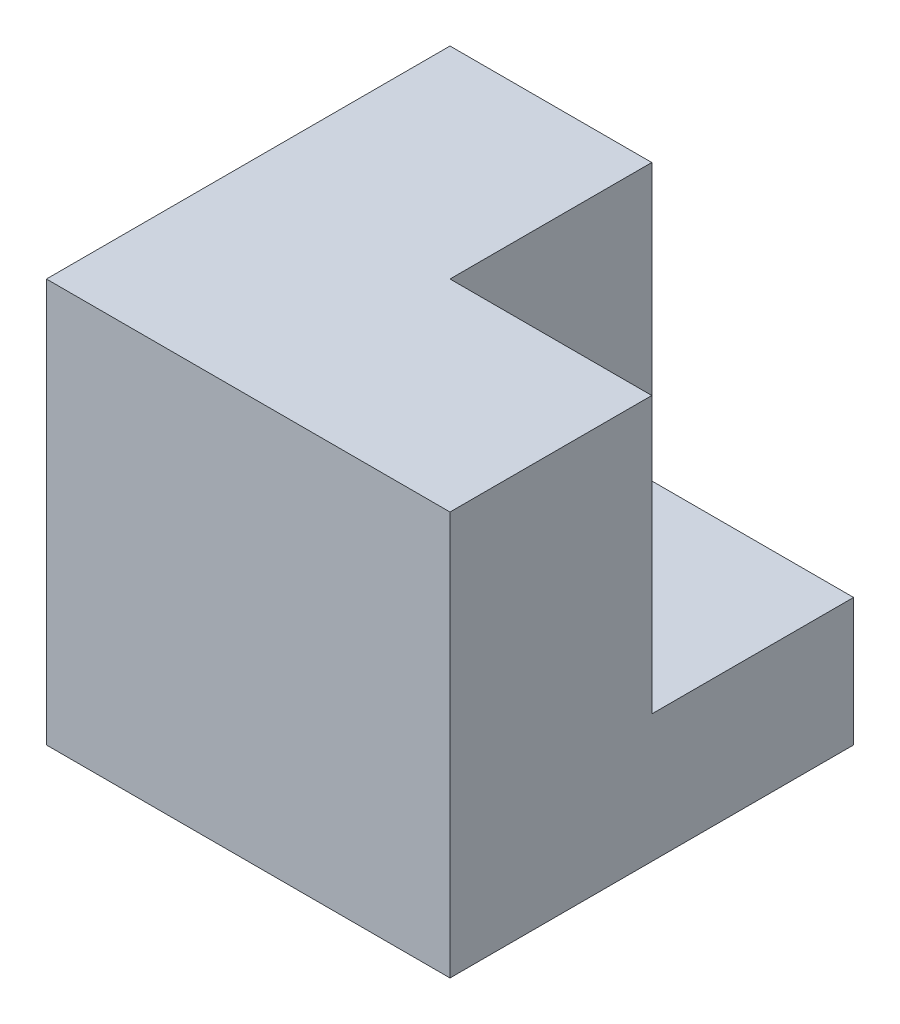
ISO-10303-21;
HEADER;
FILE_DESCRIPTION(('STEP AP214'),'2;1');
FILE_NAME('part.step','',(''),(''),'','','');
FILE_SCHEMA(('AUTOMOTIVE_DESIGN { 1 0 10303 214 1 1 1 1 }'));
ENDSEC;
DATA;
#1=APPLICATION_CONTEXT('core data for automotive mechanical design processes');
#2=APPLICATION_PROTOCOL_DEFINITION('international standard','automotive_design',2000,#1);
#3=PRODUCT_CONTEXT('',#1,'mechanical');
#4=PRODUCT('Part','Part','',(#3));
#5=PRODUCT_RELATED_PRODUCT_CATEGORY('part','',(#4));
#6=PRODUCT_DEFINITION_FORMATION('','',#4);
#7=PRODUCT_DEFINITION_CONTEXT('part definition',#1,'design');
#8=PRODUCT_DEFINITION('design','',#6,#7);
#9=PRODUCT_DEFINITION_SHAPE('','',#8);
#10=(LENGTH_UNIT() NAMED_UNIT(*) SI_UNIT(.MILLI.,.METRE.));
#11=(NAMED_UNIT(*) PLANE_ANGLE_UNIT() SI_UNIT($,.RADIAN.));
#12=(NAMED_UNIT(*) SI_UNIT($,.STERADIAN.) SOLID_ANGLE_UNIT());
#13=UNCERTAINTY_MEASURE_WITH_UNIT(LENGTH_MEASURE(1.E-05),#10,'distance_accuracy_value','');
#14=(GEOMETRIC_REPRESENTATION_CONTEXT(3) GLOBAL_UNCERTAINTY_ASSIGNED_CONTEXT((#13)) GLOBAL_UNIT_ASSIGNED_CONTEXT((#10,
#11,#12)) REPRESENTATION_CONTEXT('',''));
#15=CARTESIAN_POINT('',(0.,0.,0.));
#16=DIRECTION('',(0.,0.,1.));
#17=DIRECTION('',(1.,0.,0.));
#18=AXIS2_PLACEMENT_3D('',#15,#16,#17);
#19=CARTESIAN_POINT('',(0.,0.,76.2));
#20=DIRECTION('',(1.,0.,0.));
#21=DIRECTION('',(0.,0.,-1.));
#22=AXIS2_PLACEMENT_3D('',#19,#20,#21);
#23=PLANE('',#22);
#24=DIRECTION('',(0.,-1.,0.));
#25=VECTOR('',#24,1.);
#26=CARTESIAN_POINT('',(0.,0.,0.));
#27=LINE('',#26,#25);
#28=CARTESIAN_POINT('',(0.,76.2,0.));
#29=VERTEX_POINT('',#28);
#30=CARTESIAN_POINT('',(0.,0.,0.));
#31=VERTEX_POINT('',#30);
#32=EDGE_CURVE('E125',#29,#31,#27,.T.);
#33=ORIENTED_EDGE('',*,*,#32,.T.);
#34=DIRECTION('',(0.,0.,-1.));
#35=VECTOR('',#34,1.);
#36=CARTESIAN_POINT('',(0.,0.,76.2));
#37=LINE('',#36,#35);
#38=CARTESIAN_POINT('',(0.,0.,76.2));
#39=VERTEX_POINT('',#38);
#40=EDGE_CURVE('E11',#39,#31,#37,.T.);
#41=ORIENTED_EDGE('',*,*,#40,.F.);
#42=DIRECTION('',(0.,-1.,0.));
#43=VECTOR('',#42,1.);
#44=CARTESIAN_POINT('',(0.,0.,76.2));
#45=LINE('',#44,#43);
#46=CARTESIAN_POINT('',(0.,76.2,76.2));
#47=VERTEX_POINT('',#46);
#48=EDGE_CURVE('E127',#47,#39,#45,.T.);
#49=ORIENTED_EDGE('',*,*,#48,.F.);
#50=DIRECTION('',(0.,0.,-1.));
#51=VECTOR('',#50,1.);
#52=CARTESIAN_POINT('',(0.,76.2,76.2));
#53=LINE('',#52,#51);
#54=EDGE_CURVE('E138',#47,#29,#53,.T.);
#55=ORIENTED_EDGE('',*,*,#54,.T.);
#56=EDGE_LOOP('',(#33,#41,#49,#55));
#57=FACE_BOUND('',#56,.T.);
#58=ADVANCED_FACE('F39',(#57),#23,.F.);
#59=CARTESIAN_POINT('',(0.,0.,76.2));
#60=DIRECTION('',(0.,1.,0.));
#61=DIRECTION('',(0.,0.,1.));
#62=AXIS2_PLACEMENT_3D('',#59,#60,#61);
#63=PLANE('',#62);
#64=DIRECTION('',(1.,0.,0.));
#65=VECTOR('',#64,1.);
#66=CARTESIAN_POINT('',(0.,0.,0.));
#67=LINE('',#66,#65);
#68=CARTESIAN_POINT('',(76.2,0.,0.));
#69=VERTEX_POINT('',#68);
#70=EDGE_CURVE('E134',#31,#69,#67,.T.);
#71=ORIENTED_EDGE('',*,*,#70,.T.);
#72=DIRECTION('',(0.,0.,-1.));
#73=VECTOR('',#72,1.);
#74=CARTESIAN_POINT('',(76.2,0.,76.2));
#75=LINE('',#74,#73);
#76=CARTESIAN_POINT('',(76.2,0.,76.2));
#77=VERTEX_POINT('',#76);
#78=EDGE_CURVE('E47',#77,#69,#75,.T.);
#79=ORIENTED_EDGE('',*,*,#78,.F.);
#80=DIRECTION('',(1.,0.,0.));
#81=VECTOR('',#80,1.);
#82=CARTESIAN_POINT('',(0.,0.,76.2));
#83=LINE('',#82,#81);
#84=EDGE_CURVE('E88',#39,#77,#83,.T.);
#85=ORIENTED_EDGE('',*,*,#84,.F.);
#86=ORIENTED_EDGE('',*,*,#40,.T.);
#87=EDGE_LOOP('',(#71,#79,#85,#86));
#88=FACE_BOUND('',#87,.T.);
#89=ADVANCED_FACE('F172',(#88),#63,.F.);
#90=CARTESIAN_POINT('',(76.2,0.,76.2));
#91=DIRECTION('',(-1.,0.,0.));
#92=DIRECTION('',(0.,0.,1.));
#93=AXIS2_PLACEMENT_3D('',#90,#91,#92);
#94=PLANE('',#93);
#95=DIRECTION('',(0.,1.,0.));
#96=VECTOR('',#95,1.);
#97=CARTESIAN_POINT('',(76.2,0.,0.));
#98=LINE('',#97,#96);
#99=CARTESIAN_POINT('',(76.2,24.13,0.));
#100=VERTEX_POINT('',#99);
#101=EDGE_CURVE('E128',#69,#100,#98,.T.);
#102=ORIENTED_EDGE('',*,*,#101,.T.);
#103=DIRECTION('',(0.,0.,-1.));
#104=VECTOR('',#103,1.);
#105=CARTESIAN_POINT('',(76.2,24.13,0.));
#106=LINE('',#105,#104);
#107=CARTESIAN_POINT('',(76.2,24.13,38.1));
#108=VERTEX_POINT('',#107);
#109=EDGE_CURVE('E114',#108,#100,#106,.T.);
#110=ORIENTED_EDGE('',*,*,#109,.F.);
#111=DIRECTION('',(0.,-1.,0.));
#112=VECTOR('',#111,1.);
#113=CARTESIAN_POINT('',(76.2,76.2,38.1));
#114=LINE('',#113,#112);
#115=CARTESIAN_POINT('',(76.2,76.2,38.1));
#116=VERTEX_POINT('',#115);
#117=EDGE_CURVE('E178',#116,#108,#114,.T.);
#118=ORIENTED_EDGE('',*,*,#117,.F.);
#119=DIRECTION('',(0.,0.,-1.));
#120=VECTOR('',#119,1.);
#121=CARTESIAN_POINT('',(76.2,76.2,76.2));
#122=LINE('',#121,#120);
#123=CARTESIAN_POINT('',(76.2,76.2,76.2));
#124=VERTEX_POINT('',#123);
#125=EDGE_CURVE('E141',#124,#116,#122,.T.);
#126=ORIENTED_EDGE('',*,*,#125,.F.);
#127=DIRECTION('',(0.,1.,0.));
#128=VECTOR('',#127,1.);
#129=CARTESIAN_POINT('',(76.2,0.,76.2));
#130=LINE('',#129,#128);
#131=EDGE_CURVE('E151',#77,#124,#130,.T.);
#132=ORIENTED_EDGE('',*,*,#131,.F.);
#133=ORIENTED_EDGE('',*,*,#78,.T.);
#134=EDGE_LOOP('',(#102,#110,#118,#126,#132,#133));
#135=FACE_BOUND('',#134,.T.);
#136=ADVANCED_FACE('F148',(#135),#94,.F.);
#137=CARTESIAN_POINT('',(0.,76.2,76.2));
#138=DIRECTION('',(0.,-1.,0.));
#139=DIRECTION('',(0.,0.,-1.));
#140=AXIS2_PLACEMENT_3D('',#137,#138,#139);
#141=PLANE('',#140);
#142=ORIENTED_EDGE('',*,*,#125,.T.);
#143=DIRECTION('',(1.,0.,0.));
#144=VECTOR('',#143,1.);
#145=CARTESIAN_POINT('',(38.1,76.2,38.1));
#146=LINE('',#145,#144);
#147=CARTESIAN_POINT('',(38.1,76.2,38.1));
#148=VERTEX_POINT('',#147);
#149=EDGE_CURVE('E118',#148,#116,#146,.T.);
#150=ORIENTED_EDGE('',*,*,#149,.F.);
#151=DIRECTION('',(0.,0.,1.));
#152=VECTOR('',#151,1.);
#153=CARTESIAN_POINT('',(38.1,76.2,0.));
#154=LINE('',#153,#152);
#155=CARTESIAN_POINT('',(38.1,76.2,0.));
#156=VERTEX_POINT('',#155);
#157=EDGE_CURVE('E109',#156,#148,#154,.T.);
#158=ORIENTED_EDGE('',*,*,#157,.F.);
#159=DIRECTION('',(-1.,0.,0.));
#160=VECTOR('',#159,1.);
#161=CARTESIAN_POINT('',(0.,76.2,0.));
#162=LINE('',#161,#160);
#163=EDGE_CURVE('E81',#156,#29,#162,.T.);
#164=ORIENTED_EDGE('',*,*,#163,.T.);
#165=ORIENTED_EDGE('',*,*,#54,.F.);
#166=DIRECTION('',(-1.,0.,0.));
#167=VECTOR('',#166,1.);
#168=CARTESIAN_POINT('',(0.,76.2,76.2));
#169=LINE('',#168,#167);
#170=EDGE_CURVE('E63',#124,#47,#169,.T.);
#171=ORIENTED_EDGE('',*,*,#170,.F.);
#172=EDGE_LOOP('',(#142,#150,#158,#164,#165,#171));
#173=FACE_BOUND('',#172,.T.);
#174=ADVANCED_FACE('F117',(#173),#141,.F.);
#175=CARTESIAN_POINT('',(0.,0.,76.2));
#176=DIRECTION('',(0.,0.,-1.));
#177=DIRECTION('',(-1.,0.,0.));
#178=AXIS2_PLACEMENT_3D('',#175,#176,#177);
#179=PLANE('',#178);
#180=ORIENTED_EDGE('',*,*,#48,.T.);
#181=ORIENTED_EDGE('',*,*,#84,.T.);
#182=ORIENTED_EDGE('',*,*,#131,.T.);
#183=ORIENTED_EDGE('',*,*,#170,.T.);
#184=EDGE_LOOP('',(#180,#181,#182,#183));
#185=FACE_BOUND('',#184,.T.);
#186=ADVANCED_FACE('F208',(#185),#179,.F.);
#187=CARTESIAN_POINT('',(0.,0.,0.));
#188=DIRECTION('',(0.,0.,-1.));
#189=DIRECTION('',(-1.,0.,0.));
#190=AXIS2_PLACEMENT_3D('',#187,#188,#189);
#191=PLANE('',#190);
#192=DIRECTION('',(1.,0.,0.));
#193=VECTOR('',#192,1.);
#194=CARTESIAN_POINT('',(38.1,24.13,0.));
#195=LINE('',#194,#193);
#196=CARTESIAN_POINT('',(38.1,24.13,0.));
#197=VERTEX_POINT('',#196);
#198=EDGE_CURVE('E152',#197,#100,#195,.T.);
#199=ORIENTED_EDGE('',*,*,#198,.T.);
#200=ORIENTED_EDGE('',*,*,#101,.F.);
#201=ORIENTED_EDGE('',*,*,#70,.F.);
#202=ORIENTED_EDGE('',*,*,#32,.F.);
#203=ORIENTED_EDGE('',*,*,#163,.F.);
#204=DIRECTION('',(0.,1.,0.));
#205=VECTOR('',#204,1.);
#206=CARTESIAN_POINT('',(38.1,76.2,0.));
#207=LINE('',#206,#205);
#208=EDGE_CURVE('E107',#197,#156,#207,.T.);
#209=ORIENTED_EDGE('',*,*,#208,.F.);
#210=EDGE_LOOP('',(#199,#200,#201,#202,#203,#209));
#211=FACE_BOUND('',#210,.T.);
#212=ADVANCED_FACE('F123',(#211),#191,.T.);
#213=CARTESIAN_POINT('',(38.1,24.13,0.));
#214=DIRECTION('',(0.,-1.,0.));
#215=DIRECTION('',(0.,0.,-1.));
#216=AXIS2_PLACEMENT_3D('',#213,#214,#215);
#217=PLANE('',#216);
#218=ORIENTED_EDGE('',*,*,#109,.T.);
#219=ORIENTED_EDGE('',*,*,#198,.F.);
#220=DIRECTION('',(0.,0.,-1.));
#221=VECTOR('',#220,1.);
#222=CARTESIAN_POINT('',(38.1,24.13,0.));
#223=LINE('',#222,#221);
#224=CARTESIAN_POINT('',(38.1,24.13,38.1));
#225=VERTEX_POINT('',#224);
#226=EDGE_CURVE('E54',#225,#197,#223,.T.);
#227=ORIENTED_EDGE('',*,*,#226,.F.);
#228=DIRECTION('',(1.,0.,0.));
#229=VECTOR('',#228,1.);
#230=CARTESIAN_POINT('',(38.1,24.13,38.1));
#231=LINE('',#230,#229);
#232=EDGE_CURVE('E155',#225,#108,#231,.T.);
#233=ORIENTED_EDGE('',*,*,#232,.T.);
#234=EDGE_LOOP('',(#218,#219,#227,#233));
#235=FACE_BOUND('',#234,.T.);
#236=ADVANCED_FACE('F186',(#235),#217,.F.);
#237=CARTESIAN_POINT('',(38.1,76.2,38.1));
#238=DIRECTION('',(0.,0.,1.));
#239=DIRECTION('',(0.,-1.,0.));
#240=AXIS2_PLACEMENT_3D('',#237,#238,#239);
#241=PLANE('',#240);
#242=ORIENTED_EDGE('',*,*,#117,.T.);
#243=ORIENTED_EDGE('',*,*,#232,.F.);
#244=DIRECTION('',(0.,-1.,0.));
#245=VECTOR('',#244,1.);
#246=CARTESIAN_POINT('',(38.1,76.2,38.1));
#247=LINE('',#246,#245);
#248=EDGE_CURVE('E120',#148,#225,#247,.T.);
#249=ORIENTED_EDGE('',*,*,#248,.F.);
#250=ORIENTED_EDGE('',*,*,#149,.T.);
#251=EDGE_LOOP('',(#242,#243,#249,#250));
#252=FACE_BOUND('',#251,.T.);
#253=ADVANCED_FACE('F187',(#252),#241,.F.);
#254=CARTESIAN_POINT('',(38.1,0.,0.));
#255=DIRECTION('',(-1.,0.,0.));
#256=DIRECTION('',(0.,0.,1.));
#257=AXIS2_PLACEMENT_3D('',#254,#255,#256);
#258=PLANE('',#257);
#259=ORIENTED_EDGE('',*,*,#208,.T.);
#260=ORIENTED_EDGE('',*,*,#157,.T.);
#261=ORIENTED_EDGE('',*,*,#248,.T.);
#262=ORIENTED_EDGE('',*,*,#226,.T.);
#263=EDGE_LOOP('',(#259,#260,#261,#262));
#264=FACE_BOUND('',#263,.T.);
#265=ADVANCED_FACE('F108',(#264),#258,.F.);
#266=CLOSED_SHELL('',(#58,#89,#136,#174,#186,#212,#236,#253,#265));
#267=MANIFOLD_SOLID_BREP('B2',#266);
#268=ADVANCED_BREP_SHAPE_REPRESENTATION('',(#18,#267),#14);
#269=SHAPE_DEFINITION_REPRESENTATION(#9,#268);
ENDSEC;
END-ISO-10303-21;
